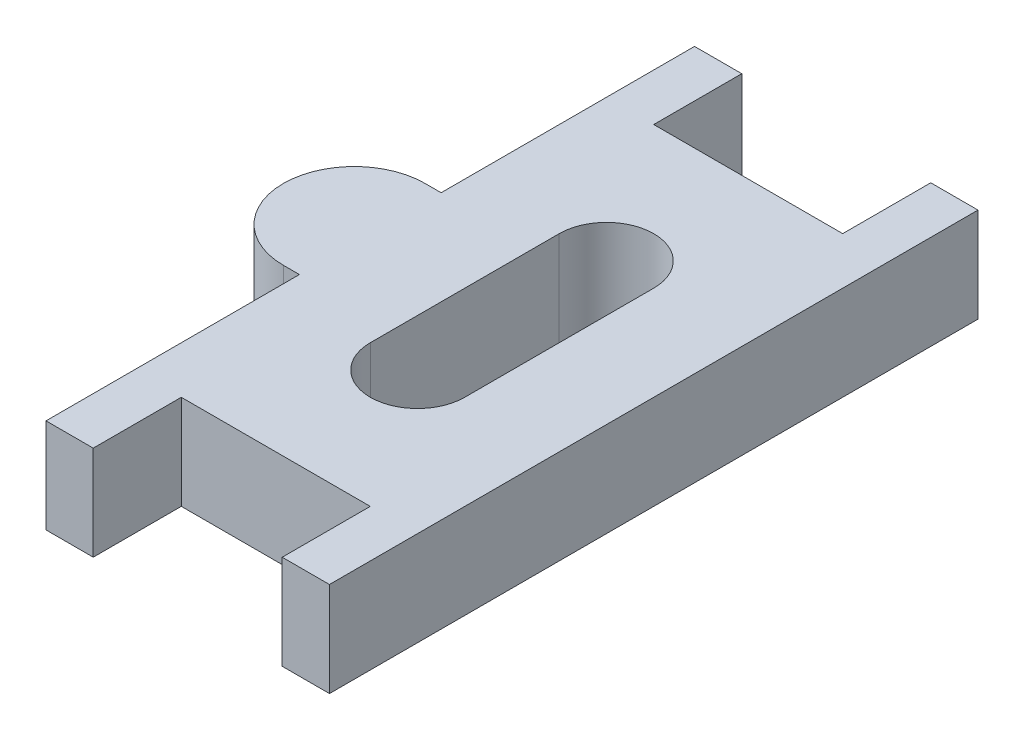
ISO-10303-21;
HEADER;
FILE_DESCRIPTION(('STEP AP214'),'2;1');
FILE_NAME('part.step','',(''),(''),'','','');
FILE_SCHEMA(('AUTOMOTIVE_DESIGN { 1 0 10303 214 1 1 1 1 }'));
ENDSEC;
DATA;
#1=APPLICATION_CONTEXT('core data for automotive mechanical design processes');
#2=APPLICATION_PROTOCOL_DEFINITION('international standard','automotive_design',2000,#1);
#3=PRODUCT_CONTEXT('',#1,'mechanical');
#4=PRODUCT('Part','Part','',(#3));
#5=PRODUCT_RELATED_PRODUCT_CATEGORY('part','',(#4));
#6=PRODUCT_DEFINITION_FORMATION('','',#4);
#7=PRODUCT_DEFINITION_CONTEXT('part definition',#1,'design');
#8=PRODUCT_DEFINITION('design','',#6,#7);
#9=PRODUCT_DEFINITION_SHAPE('','',#8);
#10=(LENGTH_UNIT() NAMED_UNIT(*) SI_UNIT(.MILLI.,.METRE.));
#11=(NAMED_UNIT(*) PLANE_ANGLE_UNIT() SI_UNIT($,.RADIAN.));
#12=(NAMED_UNIT(*) SI_UNIT($,.STERADIAN.) SOLID_ANGLE_UNIT());
#13=UNCERTAINTY_MEASURE_WITH_UNIT(LENGTH_MEASURE(1.E-05),#10,'distance_accuracy_value','');
#14=(GEOMETRIC_REPRESENTATION_CONTEXT(3) GLOBAL_UNCERTAINTY_ASSIGNED_CONTEXT((#13)) GLOBAL_UNIT_ASSIGNED_CONTEXT((#10,
#11,#12)) REPRESENTATION_CONTEXT('',''));
#15=CARTESIAN_POINT('',(0.,0.,0.));
#16=DIRECTION('',(0.,0.,1.));
#17=DIRECTION('',(1.,0.,0.));
#18=AXIS2_PLACEMENT_3D('',#15,#16,#17);
#19=CARTESIAN_POINT('',(-3.175,3.175,-10.8966));
#20=DIRECTION('',(0.,0.,1.));
#21=DIRECTION('',(1.,0.,0.));
#22=AXIS2_PLACEMENT_3D('',#19,#20,#21);
#23=PLANE('',#22);
#24=DIRECTION('',(-1.,0.,0.));
#25=VECTOR('',#24,1.);
#26=CARTESIAN_POINT('',(-3.175,0.,-10.8966));
#27=LINE('',#26,#25);
#28=CARTESIAN_POINT('',(-3.175,0.,-10.8966));
#29=VERTEX_POINT('',#28);
#30=CARTESIAN_POINT('',(-4.7625,0.,-10.8966));
#31=VERTEX_POINT('',#30);
#32=EDGE_CURVE('E183',#29,#31,#27,.T.);
#33=ORIENTED_EDGE('',*,*,#32,.T.);
#34=DIRECTION('',(0.,-1.,0.));
#35=VECTOR('',#34,1.);
#36=CARTESIAN_POINT('',(-4.7625,3.175,-10.8966));
#37=LINE('',#36,#35);
#38=CARTESIAN_POINT('',(-4.7625,3.175,-10.8966));
#39=VERTEX_POINT('',#38);
#40=EDGE_CURVE('E11',#39,#31,#37,.T.);
#41=ORIENTED_EDGE('',*,*,#40,.F.);
#42=DIRECTION('',(-1.,0.,0.));
#43=VECTOR('',#42,1.);
#44=CARTESIAN_POINT('',(-3.175,3.175,-10.8966));
#45=LINE('',#44,#43);
#46=CARTESIAN_POINT('',(-3.175,3.175,-10.8966));
#47=VERTEX_POINT('',#46);
#48=EDGE_CURVE('E206',#47,#39,#45,.T.);
#49=ORIENTED_EDGE('',*,*,#48,.F.);
#50=DIRECTION('',(0.,-1.,0.));
#51=VECTOR('',#50,1.);
#52=CARTESIAN_POINT('',(-3.175,3.175,-10.8966));
#53=LINE('',#52,#51);
#54=EDGE_CURVE('E240',#47,#29,#53,.T.);
#55=ORIENTED_EDGE('',*,*,#54,.T.);
#56=EDGE_LOOP('',(#33,#41,#49,#55));
#57=FACE_BOUND('',#56,.T.);
#58=ADVANCED_FACE('F33',(#57),#23,.F.);
#59=CARTESIAN_POINT('',(-4.7625,3.175,-10.8966));
#60=DIRECTION('',(1.,0.,0.));
#61=DIRECTION('',(0.,0.,-1.));
#62=AXIS2_PLACEMENT_3D('',#59,#60,#61);
#63=PLANE('',#62);
#64=DIRECTION('',(0.,0.,1.));
#65=VECTOR('',#64,1.);
#66=CARTESIAN_POINT('',(-4.7625,0.,-10.8966));
#67=LINE('',#66,#65);
#68=CARTESIAN_POINT('',(-4.7625,0.,-2.38125));
#69=VERTEX_POINT('',#68);
#70=EDGE_CURVE('E243',#31,#69,#67,.T.);
#71=ORIENTED_EDGE('',*,*,#70,.T.);
#72=DIRECTION('',(0.,-1.,0.));
#73=VECTOR('',#72,1.);
#74=CARTESIAN_POINT('',(-4.7625,3.175,-2.38125));
#75=LINE('',#74,#73);
#76=CARTESIAN_POINT('',(-4.7625,3.175,-2.38125));
#77=VERTEX_POINT('',#76);
#78=EDGE_CURVE('E40',#77,#69,#75,.T.);
#79=ORIENTED_EDGE('',*,*,#78,.F.);
#80=DIRECTION('',(0.,0.,1.));
#81=VECTOR('',#80,1.);
#82=CARTESIAN_POINT('',(-4.7625,3.175,-10.8966));
#83=LINE('',#82,#81);
#84=EDGE_CURVE('E209',#39,#77,#83,.T.);
#85=ORIENTED_EDGE('',*,*,#84,.F.);
#86=ORIENTED_EDGE('',*,*,#40,.T.);
#87=EDGE_LOOP('',(#71,#79,#85,#86));
#88=FACE_BOUND('',#87,.T.);
#89=ADVANCED_FACE('F338',(#88),#63,.F.);
#90=CARTESIAN_POINT('',(-5.30225,3.175,-2.38125));
#91=DIRECTION('',(0.,0.,1.));
#92=DIRECTION('',(1.,0.,0.));
#93=AXIS2_PLACEMENT_3D('',#90,#91,#92);
#94=PLANE('',#93);
#95=DIRECTION('',(-1.,0.,0.));
#96=VECTOR('',#95,1.);
#97=CARTESIAN_POINT('',(-5.30225,0.,-2.38125));
#98=LINE('',#97,#96);
#99=CARTESIAN_POINT('',(-5.30225,0.,-2.38125));
#100=VERTEX_POINT('',#99);
#101=EDGE_CURVE('E245',#69,#100,#98,.T.);
#102=ORIENTED_EDGE('',*,*,#101,.T.);
#103=DIRECTION('',(0.,-1.,0.));
#104=VECTOR('',#103,1.);
#105=CARTESIAN_POINT('',(-5.30225,3.175,-2.38125));
#106=LINE('',#105,#104);
#107=CARTESIAN_POINT('',(-5.30225,3.175,-2.38125));
#108=VERTEX_POINT('',#107);
#109=EDGE_CURVE('E310',#108,#100,#106,.T.);
#110=ORIENTED_EDGE('',*,*,#109,.F.);
#111=DIRECTION('',(-1.,0.,0.));
#112=VECTOR('',#111,1.);
#113=CARTESIAN_POINT('',(-5.30225,3.175,-2.38125));
#114=LINE('',#113,#112);
#115=EDGE_CURVE('E212',#77,#108,#114,.T.);
#116=ORIENTED_EDGE('',*,*,#115,.F.);
#117=ORIENTED_EDGE('',*,*,#78,.T.);
#118=EDGE_LOOP('',(#102,#110,#116,#117));
#119=FACE_BOUND('',#118,.T.);
#120=ADVANCED_FACE('F317',(#119),#94,.F.);
#121=CARTESIAN_POINT('',(-5.30224999999999,3.175,0.));
#122=DIRECTION('',(0.,-1.,0.));
#123=DIRECTION('',(0.,0.,-1.));
#124=AXIS2_PLACEMENT_3D('',#121,#122,#123);
#125=CYLINDRICAL_SURFACE('',#124,2.38125);
#126=CARTESIAN_POINT('',(-5.30224999999999,0.,0.));
#127=DIRECTION('',(0.,1.,0.));
#128=DIRECTION('',(0.,0.,1.));
#129=AXIS2_PLACEMENT_3D('',#126,#127,#128);
#130=CIRCLE('',#129,2.38125);
#131=CARTESIAN_POINT('',(-5.30224999999997,0.,2.38125));
#132=VERTEX_POINT('',#131);
#133=EDGE_CURVE('E247',#100,#132,#130,.T.);
#134=ORIENTED_EDGE('',*,*,#133,.T.);
#135=DIRECTION('',(0.,-1.,0.));
#136=VECTOR('',#135,1.);
#137=CARTESIAN_POINT('',(-5.30224999999997,3.175,2.38125));
#138=LINE('',#137,#136);
#139=CARTESIAN_POINT('',(-5.30224999999997,3.175,2.38125));
#140=VERTEX_POINT('',#139);
#141=EDGE_CURVE('E307',#140,#132,#138,.T.);
#142=ORIENTED_EDGE('',*,*,#141,.F.);
#143=CARTESIAN_POINT('',(-5.30224999999999,3.175,0.));
#144=DIRECTION('',(0.,1.,0.));
#145=DIRECTION('',(0.,0.,1.));
#146=AXIS2_PLACEMENT_3D('',#143,#144,#145);
#147=CIRCLE('',#146,2.38125);
#148=EDGE_CURVE('E214',#108,#140,#147,.T.);
#149=ORIENTED_EDGE('',*,*,#148,.F.);
#150=ORIENTED_EDGE('',*,*,#109,.T.);
#151=EDGE_LOOP('',(#134,#142,#149,#150));
#152=FACE_BOUND('',#151,.T.);
#153=ADVANCED_FACE('F326',(#152),#125,.T.);
#154=CARTESIAN_POINT('',(-5.30224999999997,3.175,2.38125));
#155=DIRECTION('',(0.,0.,-1.));
#156=DIRECTION('',(-1.,0.,0.));
#157=AXIS2_PLACEMENT_3D('',#154,#155,#156);
#158=PLANE('',#157);
#159=DIRECTION('',(1.,0.,0.));
#160=VECTOR('',#159,1.);
#161=CARTESIAN_POINT('',(-5.30224999999997,0.,2.38125));
#162=LINE('',#161,#160);
#163=CARTESIAN_POINT('',(-4.7625,0.,2.38125));
#164=VERTEX_POINT('',#163);
#165=EDGE_CURVE('E249',#132,#164,#162,.T.);
#166=ORIENTED_EDGE('',*,*,#165,.T.);
#167=DIRECTION('',(0.,-1.,0.));
#168=VECTOR('',#167,1.);
#169=CARTESIAN_POINT('',(-4.7625,3.175,2.38125));
#170=LINE('',#169,#168);
#171=CARTESIAN_POINT('',(-4.7625,3.175,2.38125));
#172=VERTEX_POINT('',#171);
#173=EDGE_CURVE('E304',#172,#164,#170,.T.);
#174=ORIENTED_EDGE('',*,*,#173,.F.);
#175=DIRECTION('',(1.,0.,0.));
#176=VECTOR('',#175,1.);
#177=CARTESIAN_POINT('',(-5.30224999999997,3.175,2.38125));
#178=LINE('',#177,#176);
#179=EDGE_CURVE('E216',#140,#172,#178,.T.);
#180=ORIENTED_EDGE('',*,*,#179,.F.);
#181=ORIENTED_EDGE('',*,*,#141,.T.);
#182=EDGE_LOOP('',(#166,#174,#180,#181));
#183=FACE_BOUND('',#182,.T.);
#184=ADVANCED_FACE('F330',(#183),#158,.F.);
#185=CARTESIAN_POINT('',(-4.7625,3.175,10.8966));
#186=DIRECTION('',(1.,0.,0.));
#187=DIRECTION('',(0.,0.,-1.));
#188=AXIS2_PLACEMENT_3D('',#185,#186,#187);
#189=PLANE('',#188);
#190=DIRECTION('',(0.,0.,1.));
#191=VECTOR('',#190,1.);
#192=CARTESIAN_POINT('',(-4.7625,0.,10.8966));
#193=LINE('',#192,#191);
#194=CARTESIAN_POINT('',(-4.7625,0.,10.8966));
#195=VERTEX_POINT('',#194);
#196=EDGE_CURVE('E251',#164,#195,#193,.T.);
#197=ORIENTED_EDGE('',*,*,#196,.T.);
#198=DIRECTION('',(0.,-1.,0.));
#199=VECTOR('',#198,1.);
#200=CARTESIAN_POINT('',(-4.7625,3.175,10.8966));
#201=LINE('',#200,#199);
#202=CARTESIAN_POINT('',(-4.7625,3.175,10.8966));
#203=VERTEX_POINT('',#202);
#204=EDGE_CURVE('E301',#203,#195,#201,.T.);
#205=ORIENTED_EDGE('',*,*,#204,.F.);
#206=DIRECTION('',(0.,0.,1.));
#207=VECTOR('',#206,1.);
#208=CARTESIAN_POINT('',(-4.7625,3.175,10.8966));
#209=LINE('',#208,#207);
#210=EDGE_CURVE('E218',#172,#203,#209,.T.);
#211=ORIENTED_EDGE('',*,*,#210,.F.);
#212=ORIENTED_EDGE('',*,*,#173,.T.);
#213=EDGE_LOOP('',(#197,#205,#211,#212));
#214=FACE_BOUND('',#213,.T.);
#215=ADVANCED_FACE('F391',(#214),#189,.F.);
#216=CARTESIAN_POINT('',(-3.175,3.175,10.8966));
#217=DIRECTION('',(0.,0.,-1.));
#218=DIRECTION('',(-1.,0.,0.));
#219=AXIS2_PLACEMENT_3D('',#216,#217,#218);
#220=PLANE('',#219);
#221=DIRECTION('',(1.,0.,0.));
#222=VECTOR('',#221,1.);
#223=CARTESIAN_POINT('',(-3.175,0.,10.8966));
#224=LINE('',#223,#222);
#225=CARTESIAN_POINT('',(-3.175,0.,10.8966));
#226=VERTEX_POINT('',#225);
#227=EDGE_CURVE('E253',#195,#226,#224,.T.);
#228=ORIENTED_EDGE('',*,*,#227,.T.);
#229=DIRECTION('',(0.,-1.,0.));
#230=VECTOR('',#229,1.);
#231=CARTESIAN_POINT('',(-3.175,3.175,10.8966));
#232=LINE('',#231,#230);
#233=CARTESIAN_POINT('',(-3.175,3.175,10.8966));
#234=VERTEX_POINT('',#233);
#235=EDGE_CURVE('E298',#234,#226,#232,.T.);
#236=ORIENTED_EDGE('',*,*,#235,.F.);
#237=DIRECTION('',(1.,0.,0.));
#238=VECTOR('',#237,1.);
#239=CARTESIAN_POINT('',(-3.175,3.175,10.8966));
#240=LINE('',#239,#238);
#241=EDGE_CURVE('E220',#203,#234,#240,.T.);
#242=ORIENTED_EDGE('',*,*,#241,.F.);
#243=ORIENTED_EDGE('',*,*,#204,.T.);
#244=EDGE_LOOP('',(#228,#236,#242,#243));
#245=FACE_BOUND('',#244,.T.);
#246=ADVANCED_FACE('F388',(#245),#220,.F.);
#247=CARTESIAN_POINT('',(-3.175,3.175,10.8966));
#248=DIRECTION('',(-1.,0.,0.));
#249=DIRECTION('',(0.,0.,1.));
#250=AXIS2_PLACEMENT_3D('',#247,#248,#249);
#251=PLANE('',#250);
#252=DIRECTION('',(0.,0.,-1.));
#253=VECTOR('',#252,1.);
#254=CARTESIAN_POINT('',(-3.175,0.,10.8966));
#255=LINE('',#254,#253);
#256=CARTESIAN_POINT('',(-3.175,0.,7.9375));
#257=VERTEX_POINT('',#256);
#258=EDGE_CURVE('E255',#226,#257,#255,.T.);
#259=ORIENTED_EDGE('',*,*,#258,.T.);
#260=DIRECTION('',(0.,-1.,0.));
#261=VECTOR('',#260,1.);
#262=CARTESIAN_POINT('',(-3.175,3.175,7.9375));
#263=LINE('',#262,#261);
#264=CARTESIAN_POINT('',(-3.175,3.175,7.9375));
#265=VERTEX_POINT('',#264);
#266=EDGE_CURVE('E295',#265,#257,#263,.T.);
#267=ORIENTED_EDGE('',*,*,#266,.F.);
#268=DIRECTION('',(0.,0.,-1.));
#269=VECTOR('',#268,1.);
#270=CARTESIAN_POINT('',(-3.175,3.175,10.8966));
#271=LINE('',#270,#269);
#272=EDGE_CURVE('E222',#234,#265,#271,.T.);
#273=ORIENTED_EDGE('',*,*,#272,.F.);
#274=ORIENTED_EDGE('',*,*,#235,.T.);
#275=EDGE_LOOP('',(#259,#267,#273,#274));
#276=FACE_BOUND('',#275,.T.);
#277=ADVANCED_FACE('F384',(#276),#251,.F.);
#278=CARTESIAN_POINT('',(-3.175,3.175,7.9375));
#279=DIRECTION('',(0.,0.,-1.));
#280=DIRECTION('',(-1.,0.,0.));
#281=AXIS2_PLACEMENT_3D('',#278,#279,#280);
#282=PLANE('',#281);
#283=DIRECTION('',(1.,0.,0.));
#284=VECTOR('',#283,1.);
#285=CARTESIAN_POINT('',(-3.175,0.,7.9375));
#286=LINE('',#285,#284);
#287=CARTESIAN_POINT('',(3.175,0.,7.9375));
#288=VERTEX_POINT('',#287);
#289=EDGE_CURVE('E257',#257,#288,#286,.T.);
#290=ORIENTED_EDGE('',*,*,#289,.T.);
#291=DIRECTION('',(0.,-1.,0.));
#292=VECTOR('',#291,1.);
#293=CARTESIAN_POINT('',(3.175,3.175,7.9375));
#294=LINE('',#293,#292);
#295=CARTESIAN_POINT('',(3.175,3.175,7.9375));
#296=VERTEX_POINT('',#295);
#297=EDGE_CURVE('E292',#296,#288,#294,.T.);
#298=ORIENTED_EDGE('',*,*,#297,.F.);
#299=DIRECTION('',(1.,0.,0.));
#300=VECTOR('',#299,1.);
#301=CARTESIAN_POINT('',(-3.175,3.175,7.9375));
#302=LINE('',#301,#300);
#303=EDGE_CURVE('E224',#265,#296,#302,.T.);
#304=ORIENTED_EDGE('',*,*,#303,.F.);
#305=ORIENTED_EDGE('',*,*,#266,.T.);
#306=EDGE_LOOP('',(#290,#298,#304,#305));
#307=FACE_BOUND('',#306,.T.);
#308=ADVANCED_FACE('F380',(#307),#282,.F.);
#309=CARTESIAN_POINT('',(3.175,3.175,10.8966));
#310=DIRECTION('',(1.,0.,0.));
#311=DIRECTION('',(0.,0.,-1.));
#312=AXIS2_PLACEMENT_3D('',#309,#310,#311);
#313=PLANE('',#312);
#314=DIRECTION('',(0.,0.,1.));
#315=VECTOR('',#314,1.);
#316=CARTESIAN_POINT('',(3.175,0.,10.8966));
#317=LINE('',#316,#315);
#318=CARTESIAN_POINT('',(3.175,0.,10.8966));
#319=VERTEX_POINT('',#318);
#320=EDGE_CURVE('E259',#288,#319,#317,.T.);
#321=ORIENTED_EDGE('',*,*,#320,.T.);
#322=DIRECTION('',(0.,-1.,0.));
#323=VECTOR('',#322,1.);
#324=CARTESIAN_POINT('',(3.175,3.175,10.8966));
#325=LINE('',#324,#323);
#326=CARTESIAN_POINT('',(3.175,3.175,10.8966));
#327=VERTEX_POINT('',#326);
#328=EDGE_CURVE('E289',#327,#319,#325,.T.);
#329=ORIENTED_EDGE('',*,*,#328,.F.);
#330=DIRECTION('',(0.,0.,1.));
#331=VECTOR('',#330,1.);
#332=CARTESIAN_POINT('',(3.175,3.175,10.8966));
#333=LINE('',#332,#331);
#334=EDGE_CURVE('E226',#296,#327,#333,.T.);
#335=ORIENTED_EDGE('',*,*,#334,.F.);
#336=ORIENTED_EDGE('',*,*,#297,.T.);
#337=EDGE_LOOP('',(#321,#329,#335,#336));
#338=FACE_BOUND('',#337,.T.);
#339=ADVANCED_FACE('F375',(#338),#313,.F.);
#340=CARTESIAN_POINT('',(3.175,3.175,10.8966));
#341=DIRECTION('',(0.,0.,-1.));
#342=DIRECTION('',(-1.,0.,0.));
#343=AXIS2_PLACEMENT_3D('',#340,#341,#342);
#344=PLANE('',#343);
#345=DIRECTION('',(1.,0.,0.));
#346=VECTOR('',#345,1.);
#347=CARTESIAN_POINT('',(3.175,0.,10.8966));
#348=LINE('',#347,#346);
#349=CARTESIAN_POINT('',(4.7625,0.,10.8966));
#350=VERTEX_POINT('',#349);
#351=EDGE_CURVE('E261',#319,#350,#348,.T.);
#352=ORIENTED_EDGE('',*,*,#351,.T.);
#353=DIRECTION('',(0.,-1.,0.));
#354=VECTOR('',#353,1.);
#355=CARTESIAN_POINT('',(4.7625,3.175,10.8966));
#356=LINE('',#355,#354);
#357=CARTESIAN_POINT('',(4.7625,3.175,10.8966));
#358=VERTEX_POINT('',#357);
#359=EDGE_CURVE('E286',#358,#350,#356,.T.);
#360=ORIENTED_EDGE('',*,*,#359,.F.);
#361=DIRECTION('',(1.,0.,0.));
#362=VECTOR('',#361,1.);
#363=CARTESIAN_POINT('',(3.175,3.175,10.8966));
#364=LINE('',#363,#362);
#365=EDGE_CURVE('E228',#327,#358,#364,.T.);
#366=ORIENTED_EDGE('',*,*,#365,.F.);
#367=ORIENTED_EDGE('',*,*,#328,.T.);
#368=EDGE_LOOP('',(#352,#360,#366,#367));
#369=FACE_BOUND('',#368,.T.);
#370=ADVANCED_FACE('F369',(#369),#344,.F.);
#371=CARTESIAN_POINT('',(4.7625,3.175,-10.8966));
#372=DIRECTION('',(-1.,0.,0.));
#373=DIRECTION('',(0.,0.,1.));
#374=AXIS2_PLACEMENT_3D('',#371,#372,#373);
#375=PLANE('',#374);
#376=DIRECTION('',(0.,0.,-1.));
#377=VECTOR('',#376,1.);
#378=CARTESIAN_POINT('',(4.7625,0.,-10.8966));
#379=LINE('',#378,#377);
#380=CARTESIAN_POINT('',(4.7625,0.,-10.8966));
#381=VERTEX_POINT('',#380);
#382=EDGE_CURVE('E263',#350,#381,#379,.T.);
#383=ORIENTED_EDGE('',*,*,#382,.T.);
#384=DIRECTION('',(0.,-1.,0.));
#385=VECTOR('',#384,1.);
#386=CARTESIAN_POINT('',(4.7625,3.175,-10.8966));
#387=LINE('',#386,#385);
#388=CARTESIAN_POINT('',(4.7625,3.175,-10.8966));
#389=VERTEX_POINT('',#388);
#390=EDGE_CURVE('E283',#389,#381,#387,.T.);
#391=ORIENTED_EDGE('',*,*,#390,.F.);
#392=DIRECTION('',(0.,0.,-1.));
#393=VECTOR('',#392,1.);
#394=CARTESIAN_POINT('',(4.7625,3.175,-10.8966));
#395=LINE('',#394,#393);
#396=EDGE_CURVE('E230',#358,#389,#395,.T.);
#397=ORIENTED_EDGE('',*,*,#396,.F.);
#398=ORIENTED_EDGE('',*,*,#359,.T.);
#399=EDGE_LOOP('',(#383,#391,#397,#398));
#400=FACE_BOUND('',#399,.T.);
#401=ADVANCED_FACE('F365',(#400),#375,.F.);
#402=CARTESIAN_POINT('',(3.175,3.175,-10.8966));
#403=DIRECTION('',(0.,0.,1.));
#404=DIRECTION('',(1.,0.,0.));
#405=AXIS2_PLACEMENT_3D('',#402,#403,#404);
#406=PLANE('',#405);
#407=DIRECTION('',(-1.,0.,0.));
#408=VECTOR('',#407,1.);
#409=CARTESIAN_POINT('',(3.175,0.,-10.8966));
#410=LINE('',#409,#408);
#411=CARTESIAN_POINT('',(3.175,0.,-10.8966));
#412=VERTEX_POINT('',#411);
#413=EDGE_CURVE('E265',#381,#412,#410,.T.);
#414=ORIENTED_EDGE('',*,*,#413,.T.);
#415=DIRECTION('',(0.,-1.,0.));
#416=VECTOR('',#415,1.);
#417=CARTESIAN_POINT('',(3.175,3.175,-10.8966));
#418=LINE('',#417,#416);
#419=CARTESIAN_POINT('',(3.175,3.175,-10.8966));
#420=VERTEX_POINT('',#419);
#421=EDGE_CURVE('E280',#420,#412,#418,.T.);
#422=ORIENTED_EDGE('',*,*,#421,.F.);
#423=DIRECTION('',(-1.,0.,0.));
#424=VECTOR('',#423,1.);
#425=CARTESIAN_POINT('',(3.175,3.175,-10.8966));
#426=LINE('',#425,#424);
#427=EDGE_CURVE('E232',#389,#420,#426,.T.);
#428=ORIENTED_EDGE('',*,*,#427,.F.);
#429=ORIENTED_EDGE('',*,*,#390,.T.);
#430=EDGE_LOOP('',(#414,#422,#428,#429));
#431=FACE_BOUND('',#430,.T.);
#432=ADVANCED_FACE('F360',(#431),#406,.F.);
#433=CARTESIAN_POINT('',(3.175,3.175,-10.8966));
#434=DIRECTION('',(1.,0.,0.));
#435=DIRECTION('',(0.,0.,-1.));
#436=AXIS2_PLACEMENT_3D('',#433,#434,#435);
#437=PLANE('',#436);
#438=DIRECTION('',(0.,0.,1.));
#439=VECTOR('',#438,1.);
#440=CARTESIAN_POINT('',(3.175,0.,-10.8966));
#441=LINE('',#440,#439);
#442=CARTESIAN_POINT('',(3.175,0.,-7.9375));
#443=VERTEX_POINT('',#442);
#444=EDGE_CURVE('E267',#412,#443,#441,.T.);
#445=ORIENTED_EDGE('',*,*,#444,.T.);
#446=DIRECTION('',(0.,-1.,0.));
#447=VECTOR('',#446,1.);
#448=CARTESIAN_POINT('',(3.175,3.175,-7.9375));
#449=LINE('',#448,#447);
#450=CARTESIAN_POINT('',(3.175,3.175,-7.9375));
#451=VERTEX_POINT('',#450);
#452=EDGE_CURVE('E277',#451,#443,#449,.T.);
#453=ORIENTED_EDGE('',*,*,#452,.F.);
#454=DIRECTION('',(0.,0.,1.));
#455=VECTOR('',#454,1.);
#456=CARTESIAN_POINT('',(3.175,3.175,-10.8966));
#457=LINE('',#456,#455);
#458=EDGE_CURVE('E234',#420,#451,#457,.T.);
#459=ORIENTED_EDGE('',*,*,#458,.F.);
#460=ORIENTED_EDGE('',*,*,#421,.T.);
#461=EDGE_LOOP('',(#445,#453,#459,#460));
#462=FACE_BOUND('',#461,.T.);
#463=ADVANCED_FACE('F354',(#462),#437,.F.);
#464=CARTESIAN_POINT('',(-3.175,3.175,-7.9375));
#465=DIRECTION('',(0.,0.,1.));
#466=DIRECTION('',(1.,0.,0.));
#467=AXIS2_PLACEMENT_3D('',#464,#465,#466);
#468=PLANE('',#467);
#469=DIRECTION('',(-1.,0.,0.));
#470=VECTOR('',#469,1.);
#471=CARTESIAN_POINT('',(-3.175,0.,-7.9375));
#472=LINE('',#471,#470);
#473=CARTESIAN_POINT('',(-3.175,0.,-7.9375));
#474=VERTEX_POINT('',#473);
#475=EDGE_CURVE('E269',#443,#474,#472,.T.);
#476=ORIENTED_EDGE('',*,*,#475,.T.);
#477=DIRECTION('',(0.,-1.,0.));
#478=VECTOR('',#477,1.);
#479=CARTESIAN_POINT('',(-3.175,3.175,-7.9375));
#480=LINE('',#479,#478);
#481=CARTESIAN_POINT('',(-3.175,3.175,-7.9375));
#482=VERTEX_POINT('',#481);
#483=EDGE_CURVE('E274',#482,#474,#480,.T.);
#484=ORIENTED_EDGE('',*,*,#483,.F.);
#485=DIRECTION('',(-1.,0.,0.));
#486=VECTOR('',#485,1.);
#487=CARTESIAN_POINT('',(-3.175,3.175,-7.9375));
#488=LINE('',#487,#486);
#489=EDGE_CURVE('E236',#451,#482,#488,.T.);
#490=ORIENTED_EDGE('',*,*,#489,.F.);
#491=ORIENTED_EDGE('',*,*,#452,.T.);
#492=EDGE_LOOP('',(#476,#484,#490,#491));
#493=FACE_BOUND('',#492,.T.);
#494=ADVANCED_FACE('F350',(#493),#468,.F.);
#495=CARTESIAN_POINT('',(-3.175,3.175,-10.8966));
#496=DIRECTION('',(-1.,0.,0.));
#497=DIRECTION('',(0.,0.,1.));
#498=AXIS2_PLACEMENT_3D('',#495,#496,#497);
#499=PLANE('',#498);
#500=DIRECTION('',(0.,0.,-1.));
#501=VECTOR('',#500,1.);
#502=CARTESIAN_POINT('',(-3.175,0.,-10.8966));
#503=LINE('',#502,#501);
#504=EDGE_CURVE('E210',#474,#29,#503,.T.);
#505=ORIENTED_EDGE('',*,*,#504,.T.);
#506=ORIENTED_EDGE('',*,*,#54,.F.);
#507=DIRECTION('',(0.,0.,-1.));
#508=VECTOR('',#507,1.);
#509=CARTESIAN_POINT('',(-3.175,3.175,-10.8966));
#510=LINE('',#509,#508);
#511=EDGE_CURVE('E238',#482,#47,#510,.T.);
#512=ORIENTED_EDGE('',*,*,#511,.F.);
#513=ORIENTED_EDGE('',*,*,#483,.T.);
#514=EDGE_LOOP('',(#505,#506,#512,#513));
#515=FACE_BOUND('',#514,.T.);
#516=ADVANCED_FACE('F345',(#515),#499,.F.);
#517=CARTESIAN_POINT('',(-5.30224999999999,3.175,0.));
#518=DIRECTION('',(0.,1.,0.));
#519=DIRECTION('',(0.,0.,1.));
#520=AXIS2_PLACEMENT_3D('',#517,#518,#519);
#521=PLANE('',#520);
#522=CARTESIAN_POINT('',(0.,3.175,-3.175));
#523=DIRECTION('',(0.,1.,0.));
#524=DIRECTION('',(0.,0.,1.));
#525=AXIS2_PLACEMENT_3D('',#522,#523,#524);
#526=CIRCLE('',#525,1.5875);
#527=CARTESIAN_POINT('',(1.5875,3.175,-3.175));
#528=VERTEX_POINT('',#527);
#529=CARTESIAN_POINT('',(-1.5875,3.175,-3.175));
#530=VERTEX_POINT('',#529);
#531=EDGE_CURVE('E47',#528,#530,#526,.T.);
#532=ORIENTED_EDGE('',*,*,#531,.F.);
#533=DIRECTION('',(0.,0.,-1.));
#534=VECTOR('',#533,1.);
#535=CARTESIAN_POINT('',(1.5875,3.175,-3.175));
#536=LINE('',#535,#534);
#537=CARTESIAN_POINT('',(1.5875,3.175,3.175));
#538=VERTEX_POINT('',#537);
#539=EDGE_CURVE('E177',#538,#528,#536,.T.);
#540=ORIENTED_EDGE('',*,*,#539,.F.);
#541=CARTESIAN_POINT('',(0.,3.175,3.175));
#542=DIRECTION('',(0.,1.,0.));
#543=DIRECTION('',(0.,0.,1.));
#544=AXIS2_PLACEMENT_3D('',#541,#542,#543);
#545=CIRCLE('',#544,1.5875);
#546=CARTESIAN_POINT('',(-1.5875,3.175,3.175));
#547=VERTEX_POINT('',#546);
#548=EDGE_CURVE('E197',#547,#538,#545,.T.);
#549=ORIENTED_EDGE('',*,*,#548,.F.);
#550=DIRECTION('',(0.,0.,1.));
#551=VECTOR('',#550,1.);
#552=CARTESIAN_POINT('',(-1.5875,3.175,-3.175));
#553=LINE('',#552,#551);
#554=EDGE_CURVE('E191',#530,#547,#553,.T.);
#555=ORIENTED_EDGE('',*,*,#554,.F.);
#556=EDGE_LOOP('',(#532,#540,#549,#555));
#557=FACE_BOUND('',#556,.T.);
#558=ORIENTED_EDGE('',*,*,#48,.T.);
#559=ORIENTED_EDGE('',*,*,#84,.T.);
#560=ORIENTED_EDGE('',*,*,#115,.T.);
#561=ORIENTED_EDGE('',*,*,#148,.T.);
#562=ORIENTED_EDGE('',*,*,#179,.T.);
#563=ORIENTED_EDGE('',*,*,#210,.T.);
#564=ORIENTED_EDGE('',*,*,#241,.T.);
#565=ORIENTED_EDGE('',*,*,#272,.T.);
#566=ORIENTED_EDGE('',*,*,#303,.T.);
#567=ORIENTED_EDGE('',*,*,#334,.T.);
#568=ORIENTED_EDGE('',*,*,#365,.T.);
#569=ORIENTED_EDGE('',*,*,#396,.T.);
#570=ORIENTED_EDGE('',*,*,#427,.T.);
#571=ORIENTED_EDGE('',*,*,#458,.T.);
#572=ORIENTED_EDGE('',*,*,#489,.T.);
#573=ORIENTED_EDGE('',*,*,#511,.T.);
#574=EDGE_LOOP('',(#558,#559,#560,#561,#562,#563,#564,#565,#566,#567,#568,#569,#570,#571,#572,#573));
#575=FACE_BOUND('',#574,.T.);
#576=ADVANCED_FACE('F334',(#557,#575),#521,.T.);
#577=CARTESIAN_POINT('',(-5.30224999999999,0.,0.));
#578=DIRECTION('',(0.,1.,0.));
#579=DIRECTION('',(0.,0.,1.));
#580=AXIS2_PLACEMENT_3D('',#577,#578,#579);
#581=PLANE('',#580);
#582=DIRECTION('',(0.,0.,1.));
#583=VECTOR('',#582,1.);
#584=CARTESIAN_POINT('',(1.5875,0.,-3.175));
#585=LINE('',#584,#583);
#586=CARTESIAN_POINT('',(1.5875,0.,-3.175));
#587=VERTEX_POINT('',#586);
#588=CARTESIAN_POINT('',(1.5875,0.,3.175));
#589=VERTEX_POINT('',#588);
#590=EDGE_CURVE('E189',#587,#589,#585,.T.);
#591=ORIENTED_EDGE('',*,*,#590,.F.);
#592=CARTESIAN_POINT('',(0.,0.,-3.175));
#593=DIRECTION('',(0.,1.,0.));
#594=DIRECTION('',(0.,0.,1.));
#595=AXIS2_PLACEMENT_3D('',#592,#593,#594);
#596=CIRCLE('',#595,1.5875);
#597=CARTESIAN_POINT('',(-1.5875,0.,-3.175));
#598=VERTEX_POINT('',#597);
#599=EDGE_CURVE('E171',#598,#587,#596,.F.);
#600=ORIENTED_EDGE('',*,*,#599,.F.);
#601=DIRECTION('',(0.,0.,-1.));
#602=VECTOR('',#601,1.);
#603=CARTESIAN_POINT('',(-1.5875,0.,-3.175));
#604=LINE('',#603,#602);
#605=CARTESIAN_POINT('',(-1.5875,0.,3.175));
#606=VERTEX_POINT('',#605);
#607=EDGE_CURVE('E180',#606,#598,#604,.T.);
#608=ORIENTED_EDGE('',*,*,#607,.F.);
#609=CARTESIAN_POINT('',(0.,0.,3.175));
#610=DIRECTION('',(0.,1.,0.));
#611=DIRECTION('',(0.,0.,1.));
#612=AXIS2_PLACEMENT_3D('',#609,#610,#611);
#613=CIRCLE('',#612,1.5875);
#614=EDGE_CURVE('E55',#589,#606,#613,.F.);
#615=ORIENTED_EDGE('',*,*,#614,.F.);
#616=EDGE_LOOP('',(#591,#600,#608,#615));
#617=FACE_BOUND('',#616,.T.);
#618=ORIENTED_EDGE('',*,*,#32,.F.);
#619=ORIENTED_EDGE('',*,*,#504,.F.);
#620=ORIENTED_EDGE('',*,*,#475,.F.);
#621=ORIENTED_EDGE('',*,*,#444,.F.);
#622=ORIENTED_EDGE('',*,*,#413,.F.);
#623=ORIENTED_EDGE('',*,*,#382,.F.);
#624=ORIENTED_EDGE('',*,*,#351,.F.);
#625=ORIENTED_EDGE('',*,*,#320,.F.);
#626=ORIENTED_EDGE('',*,*,#289,.F.);
#627=ORIENTED_EDGE('',*,*,#258,.F.);
#628=ORIENTED_EDGE('',*,*,#227,.F.);
#629=ORIENTED_EDGE('',*,*,#196,.F.);
#630=ORIENTED_EDGE('',*,*,#165,.F.);
#631=ORIENTED_EDGE('',*,*,#133,.F.);
#632=ORIENTED_EDGE('',*,*,#101,.F.);
#633=ORIENTED_EDGE('',*,*,#70,.F.);
#634=EDGE_LOOP('',(#618,#619,#620,#621,#622,#623,#624,#625,#626,#627,#628,#629,#630,#631,#632,#633));
#635=FACE_BOUND('',#634,.T.);
#636=ADVANCED_FACE('F186',(#617,#635),#581,.F.);
#637=CARTESIAN_POINT('',(0.,-0.00100000000000013,-3.175));
#638=DIRECTION('',(0.,1.,0.));
#639=DIRECTION('',(0.,0.,1.));
#640=AXIS2_PLACEMENT_3D('',#637,#638,#639);
#641=CYLINDRICAL_SURFACE('',#640,1.5875);
#642=ORIENTED_EDGE('',*,*,#599,.T.);
#643=DIRECTION('',(0.,1.,0.));
#644=VECTOR('',#643,1.);
#645=CARTESIAN_POINT('',(1.5875,-0.00100000000000013,-3.175));
#646=LINE('',#645,#644);
#647=EDGE_CURVE('E184',#587,#528,#646,.T.);
#648=ORIENTED_EDGE('',*,*,#647,.T.);
#649=ORIENTED_EDGE('',*,*,#531,.T.);
#650=DIRECTION('',(0.,1.,0.));
#651=VECTOR('',#650,1.);
#652=CARTESIAN_POINT('',(-1.5875,-0.00100000000000013,-3.175));
#653=LINE('',#652,#651);
#654=EDGE_CURVE('E167',#598,#530,#653,.T.);
#655=ORIENTED_EDGE('',*,*,#654,.F.);
#656=EDGE_LOOP('',(#642,#648,#649,#655));
#657=FACE_BOUND('',#656,.T.);
#658=ADVANCED_FACE('F169',(#657),#641,.F.);
#659=CARTESIAN_POINT('',(1.5875,-0.00100000000000013,-3.175));
#660=DIRECTION('',(1.,0.,0.));
#661=DIRECTION('',(0.,0.,-1.));
#662=AXIS2_PLACEMENT_3D('',#659,#660,#661);
#663=PLANE('',#662);
#664=ORIENTED_EDGE('',*,*,#590,.T.);
#665=DIRECTION('',(0.,1.,0.));
#666=VECTOR('',#665,1.);
#667=CARTESIAN_POINT('',(1.5875,-0.00100000000000013,3.175));
#668=LINE('',#667,#666);
#669=EDGE_CURVE('E203',#589,#538,#668,.T.);
#670=ORIENTED_EDGE('',*,*,#669,.T.);
#671=ORIENTED_EDGE('',*,*,#539,.T.);
#672=ORIENTED_EDGE('',*,*,#647,.F.);
#673=EDGE_LOOP('',(#664,#670,#671,#672));
#674=FACE_BOUND('',#673,.T.);
#675=ADVANCED_FACE('F526',(#674),#663,.F.);
#676=CARTESIAN_POINT('',(0.,-0.00100000000000013,3.175));
#677=DIRECTION('',(0.,1.,0.));
#678=DIRECTION('',(0.,0.,1.));
#679=AXIS2_PLACEMENT_3D('',#676,#677,#678);
#680=CYLINDRICAL_SURFACE('',#679,1.5875);
#681=ORIENTED_EDGE('',*,*,#614,.T.);
#682=DIRECTION('',(0.,1.,0.));
#683=VECTOR('',#682,1.);
#684=CARTESIAN_POINT('',(-1.5875,-0.00100000000000013,3.175));
#685=LINE('',#684,#683);
#686=EDGE_CURVE('E176',#606,#547,#685,.T.);
#687=ORIENTED_EDGE('',*,*,#686,.T.);
#688=ORIENTED_EDGE('',*,*,#548,.T.);
#689=ORIENTED_EDGE('',*,*,#669,.F.);
#690=EDGE_LOOP('',(#681,#687,#688,#689));
#691=FACE_BOUND('',#690,.T.);
#692=ADVANCED_FACE('F535',(#691),#680,.F.);
#693=CARTESIAN_POINT('',(-1.5875,-0.00100000000000013,-3.175));
#694=DIRECTION('',(-1.,0.,0.));
#695=DIRECTION('',(0.,0.,1.));
#696=AXIS2_PLACEMENT_3D('',#693,#694,#695);
#697=PLANE('',#696);
#698=ORIENTED_EDGE('',*,*,#607,.T.);
#699=ORIENTED_EDGE('',*,*,#654,.T.);
#700=ORIENTED_EDGE('',*,*,#554,.T.);
#701=ORIENTED_EDGE('',*,*,#686,.F.);
#702=EDGE_LOOP('',(#698,#699,#700,#701));
#703=FACE_BOUND('',#702,.T.);
#704=ADVANCED_FACE('F181',(#703),#697,.F.);
#705=CLOSED_SHELL('',(#58,#89,#120,#153,#184,#215,#246,#277,#308,#339,#370,#401,#432,#463,#494,
#516,#576,#636,#658,#675,#692,#704));
#706=MANIFOLD_SOLID_BREP('B2',#705);
#707=ADVANCED_BREP_SHAPE_REPRESENTATION('',(#18,#706),#14);
#708=SHAPE_DEFINITION_REPRESENTATION(#9,#707);
ENDSEC;
END-ISO-10303-21;
